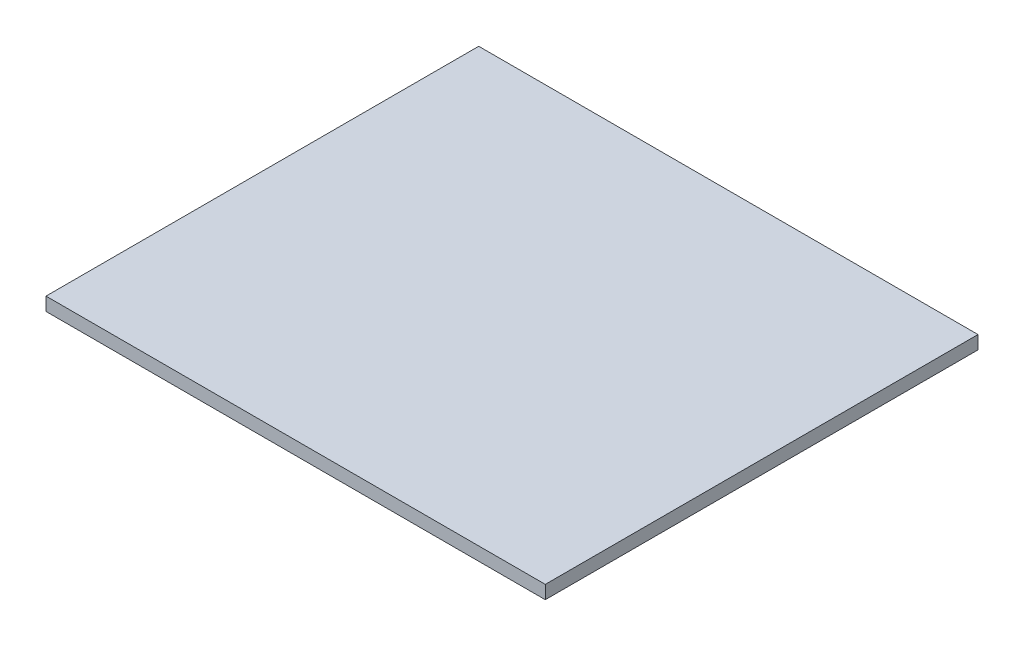
ISO-10303-21;
HEADER;
FILE_DESCRIPTION(('STEP AP214'),'2;1');
FILE_NAME('part.step','',(''),(''),'','','');
FILE_SCHEMA(('AUTOMOTIVE_DESIGN { 1 0 10303 214 1 1 1 1 }'));
ENDSEC;
DATA;
#1=APPLICATION_CONTEXT('core data for automotive mechanical design processes');
#2=APPLICATION_PROTOCOL_DEFINITION('international standard','automotive_design',2000,#1);
#3=PRODUCT_CONTEXT('',#1,'mechanical');
#4=PRODUCT('Part','Part','',(#3));
#5=PRODUCT_RELATED_PRODUCT_CATEGORY('part','',(#4));
#6=PRODUCT_DEFINITION_FORMATION('','',#4);
#7=PRODUCT_DEFINITION_CONTEXT('part definition',#1,'design');
#8=PRODUCT_DEFINITION('design','',#6,#7);
#9=PRODUCT_DEFINITION_SHAPE('','',#8);
#10=(LENGTH_UNIT() NAMED_UNIT(*) SI_UNIT(.MILLI.,.METRE.));
#11=(NAMED_UNIT(*) PLANE_ANGLE_UNIT() SI_UNIT($,.RADIAN.));
#12=(NAMED_UNIT(*) SI_UNIT($,.STERADIAN.) SOLID_ANGLE_UNIT());
#13=UNCERTAINTY_MEASURE_WITH_UNIT(LENGTH_MEASURE(1.E-05),#10,'distance_accuracy_value','');
#14=(GEOMETRIC_REPRESENTATION_CONTEXT(3) GLOBAL_UNCERTAINTY_ASSIGNED_CONTEXT((#13)) GLOBAL_UNIT_ASSIGNED_CONTEXT((#10,
#11,#12)) REPRESENTATION_CONTEXT('',''));
#15=CARTESIAN_POINT('',(0.,0.,0.));
#16=DIRECTION('',(0.,0.,1.));
#17=DIRECTION('',(1.,0.,0.));
#18=AXIS2_PLACEMENT_3D('',#15,#16,#17);
#19=CARTESIAN_POINT('',(3.60990718895759,0.4,-5.10714285714286));
#20=DIRECTION('',(0.,0.,1.));
#21=DIRECTION('',(1.,0.,0.));
#22=AXIS2_PLACEMENT_3D('',#19,#20,#21);
#23=PLANE('',#22);
#24=DIRECTION('',(-1.,0.,0.));
#25=VECTOR('',#24,1.);
#26=CARTESIAN_POINT('',(3.60990718895759,0.,-5.10714285714286));
#27=LINE('',#26,#25);
#28=CARTESIAN_POINT('',(3.60990718895759,0.,-5.10714285714286));
#29=VERTEX_POINT('',#28);
#30=CARTESIAN_POINT('',(-11.3900928110424,0.,-5.10714285714286));
#31=VERTEX_POINT('',#30);
#32=EDGE_CURVE('E111',#29,#31,#27,.T.);
#33=ORIENTED_EDGE('',*,*,#32,.T.);
#34=DIRECTION('',(0.,-1.,0.));
#35=VECTOR('',#34,1.);
#36=CARTESIAN_POINT('',(-11.3900928110424,0.4,-5.10714285714286));
#37=LINE('',#36,#35);
#38=CARTESIAN_POINT('',(-11.3900928110424,0.4,-5.10714285714286));
#39=VERTEX_POINT('',#38);
#40=EDGE_CURVE('E11',#39,#31,#37,.T.);
#41=ORIENTED_EDGE('',*,*,#40,.F.);
#42=DIRECTION('',(-1.,0.,0.));
#43=VECTOR('',#42,1.);
#44=CARTESIAN_POINT('',(3.60990718895759,0.4,-5.10714285714286));
#45=LINE('',#44,#43);
#46=CARTESIAN_POINT('',(3.60990718895759,0.4,-5.10714285714286));
#47=VERTEX_POINT('',#46);
#48=EDGE_CURVE('E95',#47,#39,#45,.T.);
#49=ORIENTED_EDGE('',*,*,#48,.F.);
#50=DIRECTION('',(0.,-1.,0.));
#51=VECTOR('',#50,1.);
#52=CARTESIAN_POINT('',(3.60990718895759,0.4,-5.10714285714286));
#53=LINE('',#52,#51);
#54=EDGE_CURVE('E107',#47,#29,#53,.T.);
#55=ORIENTED_EDGE('',*,*,#54,.T.);
#56=EDGE_LOOP('',(#33,#41,#49,#55));
#57=FACE_BOUND('',#56,.T.);
#58=ADVANCED_FACE('F43',(#57),#23,.F.);
#59=CARTESIAN_POINT('',(-11.3900928110424,0.4,-5.10714285714286));
#60=DIRECTION('',(1.,0.,0.));
#61=DIRECTION('',(0.,0.,-1.));
#62=AXIS2_PLACEMENT_3D('',#59,#60,#61);
#63=PLANE('',#62);
#64=DIRECTION('',(0.,0.,1.));
#65=VECTOR('',#64,1.);
#66=CARTESIAN_POINT('',(-11.3900928110424,0.,-5.10714285714286));
#67=LINE('',#66,#65);
#68=CARTESIAN_POINT('',(-11.3900928110424,0.,7.89285714285714));
#69=VERTEX_POINT('',#68);
#70=EDGE_CURVE('E100',#31,#69,#67,.T.);
#71=ORIENTED_EDGE('',*,*,#70,.T.);
#72=DIRECTION('',(0.,-1.,0.));
#73=VECTOR('',#72,1.);
#74=CARTESIAN_POINT('',(-11.3900928110424,0.4,7.89285714285714));
#75=LINE('',#74,#73);
#76=CARTESIAN_POINT('',(-11.3900928110424,0.4,7.89285714285714));
#77=VERTEX_POINT('',#76);
#78=EDGE_CURVE('E52',#77,#69,#75,.T.);
#79=ORIENTED_EDGE('',*,*,#78,.F.);
#80=DIRECTION('',(0.,0.,1.));
#81=VECTOR('',#80,1.);
#82=CARTESIAN_POINT('',(-11.3900928110424,0.4,-5.10714285714286));
#83=LINE('',#82,#81);
#84=EDGE_CURVE('E90',#39,#77,#83,.T.);
#85=ORIENTED_EDGE('',*,*,#84,.F.);
#86=ORIENTED_EDGE('',*,*,#40,.T.);
#87=EDGE_LOOP('',(#71,#79,#85,#86));
#88=FACE_BOUND('',#87,.T.);
#89=ADVANCED_FACE('F99',(#88),#63,.F.);
#90=CARTESIAN_POINT('',(-11.3900928110424,0.4,7.89285714285714));
#91=DIRECTION('',(0.,0.,-1.));
#92=DIRECTION('',(-1.,0.,0.));
#93=AXIS2_PLACEMENT_3D('',#90,#91,#92);
#94=PLANE('',#93);
#95=DIRECTION('',(1.,0.,0.));
#96=VECTOR('',#95,1.);
#97=CARTESIAN_POINT('',(-11.3900928110424,0.,7.89285714285714));
#98=LINE('',#97,#96);
#99=CARTESIAN_POINT('',(3.60990718895758,0.,7.89285714285714));
#100=VERTEX_POINT('',#99);
#101=EDGE_CURVE('E77',#69,#100,#98,.T.);
#102=ORIENTED_EDGE('',*,*,#101,.T.);
#103=DIRECTION('',(0.,-1.,0.));
#104=VECTOR('',#103,1.);
#105=CARTESIAN_POINT('',(3.60990718895758,0.4,7.89285714285714));
#106=LINE('',#105,#104);
#107=CARTESIAN_POINT('',(3.60990718895758,0.4,7.89285714285714));
#108=VERTEX_POINT('',#107);
#109=EDGE_CURVE('E102',#108,#100,#106,.T.);
#110=ORIENTED_EDGE('',*,*,#109,.F.);
#111=DIRECTION('',(1.,0.,0.));
#112=VECTOR('',#111,1.);
#113=CARTESIAN_POINT('',(-11.3900928110424,0.4,7.89285714285714));
#114=LINE('',#113,#112);
#115=EDGE_CURVE('E93',#77,#108,#114,.T.);
#116=ORIENTED_EDGE('',*,*,#115,.F.);
#117=ORIENTED_EDGE('',*,*,#78,.T.);
#118=EDGE_LOOP('',(#102,#110,#116,#117));
#119=FACE_BOUND('',#118,.T.);
#120=ADVANCED_FACE('F103',(#119),#94,.F.);
#121=CARTESIAN_POINT('',(3.60990718895758,0.4,7.89285714285714));
#122=DIRECTION('',(-1.,0.,0.));
#123=DIRECTION('',(0.,0.,1.));
#124=AXIS2_PLACEMENT_3D('',#121,#122,#123);
#125=PLANE('',#124);
#126=DIRECTION('',(0.,0.,-1.));
#127=VECTOR('',#126,1.);
#128=CARTESIAN_POINT('',(3.60990718895758,0.,7.89285714285714));
#129=LINE('',#128,#127);
#130=EDGE_CURVE('E83',#100,#29,#129,.T.);
#131=ORIENTED_EDGE('',*,*,#130,.T.);
#132=ORIENTED_EDGE('',*,*,#54,.F.);
#133=DIRECTION('',(0.,0.,-1.));
#134=VECTOR('',#133,1.);
#135=CARTESIAN_POINT('',(3.60990718895758,0.4,7.89285714285714));
#136=LINE('',#135,#134);
#137=EDGE_CURVE('E60',#108,#47,#136,.T.);
#138=ORIENTED_EDGE('',*,*,#137,.F.);
#139=ORIENTED_EDGE('',*,*,#109,.T.);
#140=EDGE_LOOP('',(#131,#132,#138,#139));
#141=FACE_BOUND('',#140,.T.);
#142=ADVANCED_FACE('F124',(#141),#125,.F.);
#143=CARTESIAN_POINT('',(0.,0.4,0.));
#144=DIRECTION('',(0.,1.,0.));
#145=DIRECTION('',(0.,0.,1.));
#146=AXIS2_PLACEMENT_3D('',#143,#144,#145);
#147=PLANE('',#146);
#148=ORIENTED_EDGE('',*,*,#48,.T.);
#149=ORIENTED_EDGE('',*,*,#84,.T.);
#150=ORIENTED_EDGE('',*,*,#115,.T.);
#151=ORIENTED_EDGE('',*,*,#137,.T.);
#152=EDGE_LOOP('',(#148,#149,#150,#151));
#153=FACE_BOUND('',#152,.T.);
#154=ADVANCED_FACE('F91',(#153),#147,.T.);
#155=CARTESIAN_POINT('',(0.,0.,0.));
#156=DIRECTION('',(0.,1.,0.));
#157=DIRECTION('',(0.,0.,1.));
#158=AXIS2_PLACEMENT_3D('',#155,#156,#157);
#159=PLANE('',#158);
#160=ORIENTED_EDGE('',*,*,#32,.F.);
#161=ORIENTED_EDGE('',*,*,#130,.F.);
#162=ORIENTED_EDGE('',*,*,#101,.F.);
#163=ORIENTED_EDGE('',*,*,#70,.F.);
#164=EDGE_LOOP('',(#160,#161,#162,#163));
#165=FACE_BOUND('',#164,.T.);
#166=ADVANCED_FACE('F127',(#165),#159,.F.);
#167=CLOSED_SHELL('',(#58,#89,#120,#142,#154,#166));
#168=MANIFOLD_SOLID_BREP('B2',#167);
#169=ADVANCED_BREP_SHAPE_REPRESENTATION('',(#18,#168),#14);
#170=SHAPE_DEFINITION_REPRESENTATION(#9,#169);
ENDSEC;
END-ISO-10303-21;
